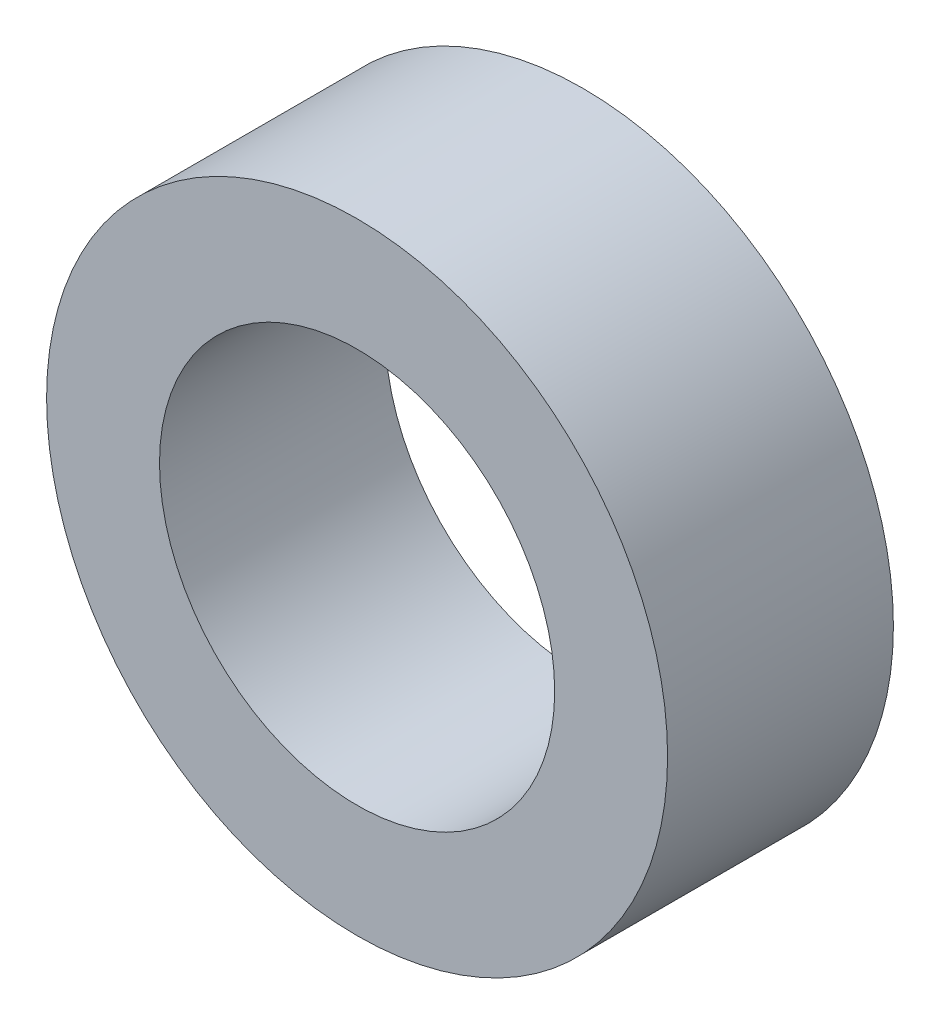
ISO-10303-21;
HEADER;
FILE_DESCRIPTION(('STEP AP214'),'2;1');
FILE_NAME('part.step','',(''),(''),'','','');
FILE_SCHEMA(('AUTOMOTIVE_DESIGN { 1 0 10303 214 1 1 1 1 }'));
ENDSEC;
DATA;
#1=APPLICATION_CONTEXT('core data for automotive mechanical design processes');
#2=APPLICATION_PROTOCOL_DEFINITION('international standard','automotive_design',2000,#1);
#3=PRODUCT_CONTEXT('',#1,'mechanical');
#4=PRODUCT('Part','Part','',(#3));
#5=PRODUCT_RELATED_PRODUCT_CATEGORY('part','',(#4));
#6=PRODUCT_DEFINITION_FORMATION('','',#4);
#7=PRODUCT_DEFINITION_CONTEXT('part definition',#1,'design');
#8=PRODUCT_DEFINITION('design','',#6,#7);
#9=PRODUCT_DEFINITION_SHAPE('','',#8);
#10=(LENGTH_UNIT() NAMED_UNIT(*) SI_UNIT(.MILLI.,.METRE.));
#11=(NAMED_UNIT(*) PLANE_ANGLE_UNIT() SI_UNIT($,.RADIAN.));
#12=(NAMED_UNIT(*) SI_UNIT($,.STERADIAN.) SOLID_ANGLE_UNIT());
#13=UNCERTAINTY_MEASURE_WITH_UNIT(LENGTH_MEASURE(1.E-05),#10,'distance_accuracy_value','');
#14=(GEOMETRIC_REPRESENTATION_CONTEXT(3) GLOBAL_UNCERTAINTY_ASSIGNED_CONTEXT((#13)) GLOBAL_UNIT_ASSIGNED_CONTEXT((#10,
#11,#12)) REPRESENTATION_CONTEXT('',''));
#15=CARTESIAN_POINT('',(0.,0.,0.));
#16=DIRECTION('',(0.,0.,1.));
#17=DIRECTION('',(1.,0.,0.));
#18=AXIS2_PLACEMENT_3D('',#15,#16,#17);
#19=CARTESIAN_POINT('',(0.,0.,32.));
#20=DIRECTION('',(0.,0.,1.));
#21=DIRECTION('',(1.,0.,0.));
#22=AXIS2_PLACEMENT_3D('',#19,#20,#21);
#23=PLANE('',#22);
#24=CARTESIAN_POINT('',(0.,0.,32.));
#25=DIRECTION('',(0.,0.,1.));
#26=DIRECTION('',(1.,0.,0.));
#27=AXIS2_PLACEMENT_3D('',#24,#25,#26);
#28=CIRCLE('',#27,44.);
#29=CARTESIAN_POINT('',(44.,0.,32.));
#30=VERTEX_POINT('',#29);
#31=EDGE_CURVE('E10',#30,#30,#28,.T.);
#32=ORIENTED_EDGE('',*,*,#31,.T.);
#33=EDGE_LOOP('',(#32));
#34=FACE_BOUND('',#33,.T.);
#35=CARTESIAN_POINT('',(0.,0.,32.));
#36=DIRECTION('',(0.,0.,1.));
#37=DIRECTION('',(1.,0.,0.));
#38=AXIS2_PLACEMENT_3D('',#35,#36,#37);
#39=CIRCLE('',#38,28.);
#40=CARTESIAN_POINT('',(28.,0.,32.));
#41=VERTEX_POINT('',#40);
#42=EDGE_CURVE('E54',#41,#41,#39,.T.);
#43=ORIENTED_EDGE('',*,*,#42,.F.);
#44=EDGE_LOOP('',(#43));
#45=FACE_BOUND('',#44,.T.);
#46=ADVANCED_FACE('F41',(#34,#45),#23,.T.);
#47=CARTESIAN_POINT('',(0.,0.,0.));
#48=DIRECTION('',(0.,0.,1.));
#49=DIRECTION('',(1.,0.,0.));
#50=AXIS2_PLACEMENT_3D('',#47,#48,#49);
#51=PLANE('',#50);
#52=CARTESIAN_POINT('',(0.,0.,0.));
#53=DIRECTION('',(0.,0.,1.));
#54=DIRECTION('',(1.,0.,0.));
#55=AXIS2_PLACEMENT_3D('',#52,#53,#54);
#56=CIRCLE('',#55,44.);
#57=CARTESIAN_POINT('',(44.,0.,0.));
#58=VERTEX_POINT('',#57);
#59=EDGE_CURVE('E45',#58,#58,#56,.T.);
#60=ORIENTED_EDGE('',*,*,#59,.F.);
#61=EDGE_LOOP('',(#60));
#62=FACE_BOUND('',#61,.T.);
#63=CARTESIAN_POINT('',(0.,0.,0.));
#64=DIRECTION('',(0.,0.,1.));
#65=DIRECTION('',(1.,0.,0.));
#66=AXIS2_PLACEMENT_3D('',#63,#64,#65);
#67=CIRCLE('',#66,28.);
#68=CARTESIAN_POINT('',(28.,0.,0.));
#69=VERTEX_POINT('',#68);
#70=EDGE_CURVE('E56',#69,#69,#67,.T.);
#71=ORIENTED_EDGE('',*,*,#70,.T.);
#72=EDGE_LOOP('',(#71));
#73=FACE_BOUND('',#72,.T.);
#74=ADVANCED_FACE('F68',(#62,#73),#51,.F.);
#75=CARTESIAN_POINT('',(0.,0.,32.));
#76=DIRECTION('',(0.,0.,-1.));
#77=DIRECTION('',(-1.,0.,0.));
#78=AXIS2_PLACEMENT_3D('',#75,#76,#77);
#79=CYLINDRICAL_SURFACE('',#78,44.);
#80=ORIENTED_EDGE('',*,*,#31,.F.);
#81=EDGE_LOOP('',(#80));
#82=FACE_BOUND('',#81,.T.);
#83=ORIENTED_EDGE('',*,*,#59,.T.);
#84=EDGE_LOOP('',(#83));
#85=FACE_BOUND('',#84,.T.);
#86=ADVANCED_FACE('F43',(#82,#85),#79,.T.);
#87=CARTESIAN_POINT('',(0.,0.,32.));
#88=DIRECTION('',(0.,0.,-1.));
#89=DIRECTION('',(-1.,0.,0.));
#90=AXIS2_PLACEMENT_3D('',#87,#88,#89);
#91=CYLINDRICAL_SURFACE('',#90,28.);
#92=ORIENTED_EDGE('',*,*,#42,.T.);
#93=EDGE_LOOP('',(#92));
#94=FACE_BOUND('',#93,.T.);
#95=ORIENTED_EDGE('',*,*,#70,.F.);
#96=EDGE_LOOP('',(#95));
#97=FACE_BOUND('',#96,.T.);
#98=ADVANCED_FACE('F64',(#94,#97),#91,.F.);
#99=CLOSED_SHELL('',(#46,#74,#86,#98));
#100=MANIFOLD_SOLID_BREP('B2',#99);
#101=ADVANCED_BREP_SHAPE_REPRESENTATION('',(#18,#100),#14);
#102=SHAPE_DEFINITION_REPRESENTATION(#9,#101);
ENDSEC;
END-ISO-10303-21;
